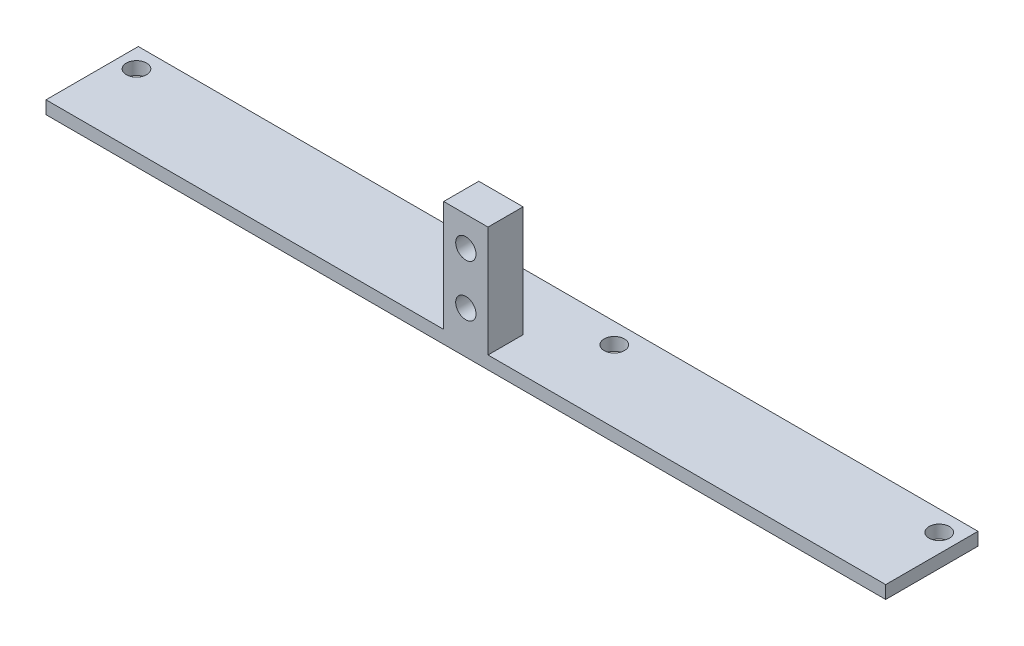
ISO-10303-21;
HEADER;
FILE_DESCRIPTION(('STEP AP214'),'2;1');
FILE_NAME('part.step','',(''),(''),'','','');
FILE_SCHEMA(('AUTOMOTIVE_DESIGN { 1 0 10303 214 1 1 1 1 }'));
ENDSEC;
DATA;
#1=APPLICATION_CONTEXT('core data for automotive mechanical design processes');
#2=APPLICATION_PROTOCOL_DEFINITION('international standard','automotive_design',2000,#1);
#3=PRODUCT_CONTEXT('',#1,'mechanical');
#4=PRODUCT('Part','Part','',(#3));
#5=PRODUCT_RELATED_PRODUCT_CATEGORY('part','',(#4));
#6=PRODUCT_DEFINITION_FORMATION('','',#4);
#7=PRODUCT_DEFINITION_CONTEXT('part definition',#1,'design');
#8=PRODUCT_DEFINITION('design','',#6,#7);
#9=PRODUCT_DEFINITION_SHAPE('','',#8);
#10=(LENGTH_UNIT() NAMED_UNIT(*) SI_UNIT(.MILLI.,.METRE.));
#11=(NAMED_UNIT(*) PLANE_ANGLE_UNIT() SI_UNIT($,.RADIAN.));
#12=(NAMED_UNIT(*) SI_UNIT($,.STERADIAN.) SOLID_ANGLE_UNIT());
#13=UNCERTAINTY_MEASURE_WITH_UNIT(LENGTH_MEASURE(1.E-05),#10,'distance_accuracy_value','');
#14=(GEOMETRIC_REPRESENTATION_CONTEXT(3) GLOBAL_UNCERTAINTY_ASSIGNED_CONTEXT((#13)) GLOBAL_UNIT_ASSIGNED_CONTEXT((#10,
#11,#12)) REPRESENTATION_CONTEXT('',''));
#15=CARTESIAN_POINT('',(0.,0.,0.));
#16=DIRECTION('',(0.,0.,1.));
#17=DIRECTION('',(1.,0.,0.));
#18=AXIS2_PLACEMENT_3D('',#15,#16,#17);
#19=CARTESIAN_POINT('',(0.,1.75,0.));
#20=DIRECTION('',(0.,0.,-1.));
#21=DIRECTION('',(-1.,0.,0.));
#22=AXIS2_PLACEMENT_3D('',#19,#20,#21);
#23=PLANE('',#22);
#24=CARTESIAN_POINT('',(57.35,5.75,0.));
#25=DIRECTION('',(0.,0.,-1.));
#26=DIRECTION('',(-1.,0.,0.));
#27=AXIS2_PLACEMENT_3D('',#24,#25,#26);
#28=CIRCLE('',#27,1.375);
#29=CARTESIAN_POINT('',(55.975,5.75,0.));
#30=VERTEX_POINT('',#29);
#31=EDGE_CURVE('E215',#30,#30,#28,.T.);
#32=ORIENTED_EDGE('',*,*,#31,.T.);
#33=EDGE_LOOP('',(#32));
#34=FACE_BOUND('',#33,.T.);
#35=CARTESIAN_POINT('',(57.35,12.75,0.));
#36=DIRECTION('',(0.,0.,-1.));
#37=DIRECTION('',(-1.,0.,0.));
#38=AXIS2_PLACEMENT_3D('',#35,#36,#37);
#39=CIRCLE('',#38,1.375);
#40=CARTESIAN_POINT('',(55.975,12.75,0.));
#41=VERTEX_POINT('',#40);
#42=EDGE_CURVE('E201',#41,#41,#39,.T.);
#43=ORIENTED_EDGE('',*,*,#42,.T.);
#44=EDGE_LOOP('',(#43));
#45=FACE_BOUND('',#44,.T.);
#46=DIRECTION('',(1.,0.,0.));
#47=VECTOR('',#46,1.);
#48=CARTESIAN_POINT('',(0.,0.,0.));
#49=LINE('',#48,#47);
#50=CARTESIAN_POINT('',(0.5,0.,0.));
#51=VERTEX_POINT('',#50);
#52=CARTESIAN_POINT('',(114.2,0.,0.));
#53=VERTEX_POINT('',#52);
#54=EDGE_CURVE('E128',#51,#53,#49,.T.);
#55=ORIENTED_EDGE('',*,*,#54,.T.);
#56=DIRECTION('',(0.,1.,0.));
#57=VECTOR('',#56,1.);
#58=CARTESIAN_POINT('',(114.2,0.,0.));
#59=LINE('',#58,#57);
#60=CARTESIAN_POINT('',(114.2,1.75,0.));
#61=VERTEX_POINT('',#60);
#62=EDGE_CURVE('E67',#53,#61,#59,.T.);
#63=ORIENTED_EDGE('',*,*,#62,.T.);
#64=DIRECTION('',(1.,0.,0.));
#65=VECTOR('',#64,1.);
#66=CARTESIAN_POINT('',(0.,1.75,0.));
#67=LINE('',#66,#65);
#68=CARTESIAN_POINT('',(60.35,1.75,0.));
#69=VERTEX_POINT('',#68);
#70=EDGE_CURVE('E127',#69,#61,#67,.T.);
#71=ORIENTED_EDGE('',*,*,#70,.F.);
#72=DIRECTION('',(0.,1.,0.));
#73=VECTOR('',#72,1.);
#74=CARTESIAN_POINT('',(60.35,0.,0.));
#75=LINE('',#74,#73);
#76=CARTESIAN_POINT('',(60.35,16.75,0.));
#77=VERTEX_POINT('',#76);
#78=EDGE_CURVE('E194',#69,#77,#75,.T.);
#79=ORIENTED_EDGE('',*,*,#78,.T.);
#80=DIRECTION('',(-1.,0.,0.));
#81=VECTOR('',#80,1.);
#82=CARTESIAN_POINT('',(54.35,16.75,0.));
#83=LINE('',#82,#81);
#84=CARTESIAN_POINT('',(54.35,16.75,0.));
#85=VERTEX_POINT('',#84);
#86=EDGE_CURVE('E189',#77,#85,#83,.T.);
#87=ORIENTED_EDGE('',*,*,#86,.T.);
#88=DIRECTION('',(0.,-1.,0.));
#89=VECTOR('',#88,1.);
#90=CARTESIAN_POINT('',(54.35,0.,0.));
#91=LINE('',#90,#89);
#92=CARTESIAN_POINT('',(54.35,1.75,0.));
#93=VERTEX_POINT('',#92);
#94=EDGE_CURVE('E197',#85,#93,#91,.T.);
#95=ORIENTED_EDGE('',*,*,#94,.T.);
#96=CARTESIAN_POINT('',(0.5,1.75,0.));
#97=VERTEX_POINT('',#96);
#98=EDGE_CURVE('E51',#97,#93,#67,.T.);
#99=ORIENTED_EDGE('',*,*,#98,.F.);
#100=DIRECTION('',(0.,1.,0.));
#101=VECTOR('',#100,1.);
#102=CARTESIAN_POINT('',(0.5,0.,0.));
#103=LINE('',#102,#101);
#104=EDGE_CURVE('E233',#51,#97,#103,.T.);
#105=ORIENTED_EDGE('',*,*,#104,.F.);
#106=EDGE_LOOP('',(#55,#63,#71,#79,#87,#95,#99,#105));
#107=FACE_BOUND('',#106,.T.);
#108=ADVANCED_FACE('F42',(#34,#45,#107),#23,.F.);
#109=CARTESIAN_POINT('',(0.,1.75,-12.5));
#110=DIRECTION('',(0.,0.,1.));
#111=DIRECTION('',(1.,0.,0.));
#112=AXIS2_PLACEMENT_3D('',#109,#110,#111);
#113=PLANE('',#112);
#114=DIRECTION('',(-1.,0.,0.));
#115=VECTOR('',#114,1.);
#116=CARTESIAN_POINT('',(0.,1.75,-12.5));
#117=LINE('',#116,#115);
#118=CARTESIAN_POINT('',(114.2,1.75,-12.5));
#119=VERTEX_POINT('',#118);
#120=CARTESIAN_POINT('',(0.5,1.75,-12.5));
#121=VERTEX_POINT('',#120);
#122=EDGE_CURVE('E11',#119,#121,#117,.T.);
#123=ORIENTED_EDGE('',*,*,#122,.F.);
#124=DIRECTION('',(0.,1.,0.));
#125=VECTOR('',#124,1.);
#126=CARTESIAN_POINT('',(114.2,0.,-12.5));
#127=LINE('',#126,#125);
#128=CARTESIAN_POINT('',(114.2,0.,-12.5));
#129=VERTEX_POINT('',#128);
#130=EDGE_CURVE('E109',#129,#119,#127,.T.);
#131=ORIENTED_EDGE('',*,*,#130,.F.);
#132=DIRECTION('',(-1.,0.,0.));
#133=VECTOR('',#132,1.);
#134=CARTESIAN_POINT('',(0.,0.,-12.5));
#135=LINE('',#134,#133);
#136=CARTESIAN_POINT('',(0.5,0.,-12.5));
#137=VERTEX_POINT('',#136);
#138=EDGE_CURVE('E45',#129,#137,#135,.T.);
#139=ORIENTED_EDGE('',*,*,#138,.T.);
#140=DIRECTION('',(0.,1.,0.));
#141=VECTOR('',#140,1.);
#142=CARTESIAN_POINT('',(0.5,0.,-12.5));
#143=LINE('',#142,#141);
#144=EDGE_CURVE('E59',#137,#121,#143,.T.);
#145=ORIENTED_EDGE('',*,*,#144,.T.);
#146=EDGE_LOOP('',(#123,#131,#139,#145));
#147=FACE_BOUND('',#146,.T.);
#148=ADVANCED_FACE('F120',(#147),#113,.F.);
#149=CARTESIAN_POINT('',(0.,1.75,0.));
#150=DIRECTION('',(0.,-1.,0.));
#151=DIRECTION('',(0.,0.,-1.));
#152=AXIS2_PLACEMENT_3D('',#149,#150,#151);
#153=PLANE('',#152);
#154=ORIENTED_EDGE('',*,*,#70,.T.);
#155=DIRECTION('',(0.,0.,-1.));
#156=VECTOR('',#155,1.);
#157=CARTESIAN_POINT('',(114.2,1.75,0.));
#158=LINE('',#157,#156);
#159=EDGE_CURVE('E223',#61,#119,#158,.T.);
#160=ORIENTED_EDGE('',*,*,#159,.T.);
#161=ORIENTED_EDGE('',*,*,#122,.T.);
#162=DIRECTION('',(0.,0.,1.));
#163=VECTOR('',#162,1.);
#164=CARTESIAN_POINT('',(0.5,1.75,0.));
#165=LINE('',#164,#163);
#166=EDGE_CURVE('E229',#121,#97,#165,.T.);
#167=ORIENTED_EDGE('',*,*,#166,.T.);
#168=ORIENTED_EDGE('',*,*,#98,.T.);
#169=DIRECTION('',(0.,0.,-1.));
#170=VECTOR('',#169,1.);
#171=CARTESIAN_POINT('',(54.35,1.75,0.));
#172=LINE('',#171,#170);
#173=CARTESIAN_POINT('',(54.35,1.75,-4.75));
#174=VERTEX_POINT('',#173);
#175=EDGE_CURVE('E149',#93,#174,#172,.T.);
#176=ORIENTED_EDGE('',*,*,#175,.T.);
#177=DIRECTION('',(1.,0.,0.));
#178=VECTOR('',#177,1.);
#179=CARTESIAN_POINT('',(0.,1.75,-4.75));
#180=LINE('',#179,#178);
#181=CARTESIAN_POINT('',(60.35,1.75,-4.75));
#182=VERTEX_POINT('',#181);
#183=EDGE_CURVE('E178',#174,#182,#180,.T.);
#184=ORIENTED_EDGE('',*,*,#183,.T.);
#185=DIRECTION('',(0.,0.,1.));
#186=VECTOR('',#185,1.);
#187=CARTESIAN_POINT('',(60.35,1.75,0.));
#188=LINE('',#187,#186);
#189=EDGE_CURVE('E174',#182,#69,#188,.T.);
#190=ORIENTED_EDGE('',*,*,#189,.T.);
#191=EDGE_LOOP('',(#154,#160,#161,#167,#168,#176,#184,#190));
#192=FACE_BOUND('',#191,.T.);
#193=CARTESIAN_POINT('',(3.,1.75,-9.75));
#194=DIRECTION('',(0.,1.,0.));
#195=DIRECTION('',(0.,0.,1.));
#196=AXIS2_PLACEMENT_3D('',#193,#194,#195);
#197=CIRCLE('',#196,1.375);
#198=CARTESIAN_POINT('',(3.,1.75,-8.375));
#199=VERTEX_POINT('',#198);
#200=EDGE_CURVE('E140',#199,#199,#197,.T.);
#201=ORIENTED_EDGE('',*,*,#200,.F.);
#202=EDGE_LOOP('',(#201));
#203=FACE_BOUND('',#202,.T.);
#204=CARTESIAN_POINT('',(47.,1.75,-9.75));
#205=DIRECTION('',(0.,1.,0.));
#206=DIRECTION('',(0.,0.,1.));
#207=AXIS2_PLACEMENT_3D('',#204,#205,#206);
#208=CIRCLE('',#207,1.375);
#209=CARTESIAN_POINT('',(47.,1.75,-8.37499999999999));
#210=VERTEX_POINT('',#209);
#211=EDGE_CURVE('E161',#210,#210,#208,.T.);
#212=ORIENTED_EDGE('',*,*,#211,.F.);
#213=EDGE_LOOP('',(#212));
#214=FACE_BOUND('',#213,.T.);
#215=CARTESIAN_POINT('',(67.7,1.75,-9.75));
#216=DIRECTION('',(0.,1.,0.));
#217=DIRECTION('',(0.,0.,-1.));
#218=AXIS2_PLACEMENT_3D('',#215,#216,#217);
#219=CIRCLE('',#218,1.375);
#220=CARTESIAN_POINT('',(67.7,1.75,-11.125));
#221=VERTEX_POINT('',#220);
#222=EDGE_CURVE('E153',#221,#221,#219,.T.);
#223=ORIENTED_EDGE('',*,*,#222,.F.);
#224=EDGE_LOOP('',(#223));
#225=FACE_BOUND('',#224,.T.);
#226=CARTESIAN_POINT('',(111.7,1.75,-9.75));
#227=DIRECTION('',(0.,1.,0.));
#228=DIRECTION('',(0.,0.,-1.));
#229=AXIS2_PLACEMENT_3D('',#226,#227,#228);
#230=CIRCLE('',#229,1.375);
#231=CARTESIAN_POINT('',(111.7,1.75,-11.125));
#232=VERTEX_POINT('',#231);
#233=EDGE_CURVE('E144',#232,#232,#230,.T.);
#234=ORIENTED_EDGE('',*,*,#233,.F.);
#235=EDGE_LOOP('',(#234));
#236=FACE_BOUND('',#235,.T.);
#237=ADVANCED_FACE('F243',(#192,#203,#214,#225,#236),#153,.F.);
#238=CARTESIAN_POINT('',(0.,0.,0.));
#239=DIRECTION('',(0.,-1.,0.));
#240=DIRECTION('',(0.,0.,-1.));
#241=AXIS2_PLACEMENT_3D('',#238,#239,#240);
#242=PLANE('',#241);
#243=DIRECTION('',(0.,0.,1.));
#244=VECTOR('',#243,1.);
#245=CARTESIAN_POINT('',(114.2,0.,-12.5));
#246=LINE('',#245,#244);
#247=EDGE_CURVE('E106',#129,#53,#246,.T.);
#248=ORIENTED_EDGE('',*,*,#247,.T.);
#249=ORIENTED_EDGE('',*,*,#54,.F.);
#250=DIRECTION('',(0.,0.,-1.));
#251=VECTOR('',#250,1.);
#252=CARTESIAN_POINT('',(0.5,0.,-12.5));
#253=LINE('',#252,#251);
#254=EDGE_CURVE('E125',#51,#137,#253,.T.);
#255=ORIENTED_EDGE('',*,*,#254,.T.);
#256=ORIENTED_EDGE('',*,*,#138,.F.);
#257=EDGE_LOOP('',(#248,#249,#255,#256));
#258=FACE_BOUND('',#257,.T.);
#259=CARTESIAN_POINT('',(3.,0.,-9.75));
#260=DIRECTION('',(0.,1.,0.));
#261=DIRECTION('',(0.,0.,1.));
#262=AXIS2_PLACEMENT_3D('',#259,#260,#261);
#263=CIRCLE('',#262,1.375);
#264=CARTESIAN_POINT('',(3.,0.,-8.375));
#265=VERTEX_POINT('',#264);
#266=EDGE_CURVE('E134',#265,#265,#263,.T.);
#267=ORIENTED_EDGE('',*,*,#266,.T.);
#268=EDGE_LOOP('',(#267));
#269=FACE_BOUND('',#268,.T.);
#270=CARTESIAN_POINT('',(47.,0.,-9.75));
#271=DIRECTION('',(0.,1.,0.));
#272=DIRECTION('',(0.,0.,1.));
#273=AXIS2_PLACEMENT_3D('',#270,#271,#272);
#274=CIRCLE('',#273,1.375);
#275=CARTESIAN_POINT('',(47.,0.,-8.37499999999999));
#276=VERTEX_POINT('',#275);
#277=EDGE_CURVE('E165',#276,#276,#274,.T.);
#278=ORIENTED_EDGE('',*,*,#277,.T.);
#279=EDGE_LOOP('',(#278));
#280=FACE_BOUND('',#279,.T.);
#281=CARTESIAN_POINT('',(67.7,0.,-9.75));
#282=DIRECTION('',(0.,1.,0.));
#283=DIRECTION('',(0.,0.,-1.));
#284=AXIS2_PLACEMENT_3D('',#281,#282,#283);
#285=CIRCLE('',#284,1.375);
#286=CARTESIAN_POINT('',(67.7,0.,-11.125));
#287=VERTEX_POINT('',#286);
#288=EDGE_CURVE('E157',#287,#287,#285,.T.);
#289=ORIENTED_EDGE('',*,*,#288,.T.);
#290=EDGE_LOOP('',(#289));
#291=FACE_BOUND('',#290,.T.);
#292=CARTESIAN_POINT('',(111.7,0.,-9.75));
#293=DIRECTION('',(0.,1.,0.));
#294=DIRECTION('',(0.,0.,-1.));
#295=AXIS2_PLACEMENT_3D('',#292,#293,#294);
#296=CIRCLE('',#295,1.375);
#297=CARTESIAN_POINT('',(111.7,0.,-11.125));
#298=VERTEX_POINT('',#297);
#299=EDGE_CURVE('E148',#298,#298,#296,.T.);
#300=ORIENTED_EDGE('',*,*,#299,.T.);
#301=EDGE_LOOP('',(#300));
#302=FACE_BOUND('',#301,.T.);
#303=ADVANCED_FACE('F123',(#258,#269,#280,#291,#302),#242,.T.);
#304=CARTESIAN_POINT('',(111.7,0.,-9.75));
#305=DIRECTION('',(0.,1.,0.));
#306=DIRECTION('',(0.,0.,1.));
#307=AXIS2_PLACEMENT_3D('',#304,#305,#306);
#308=CYLINDRICAL_SURFACE('',#307,1.375);
#309=ORIENTED_EDGE('',*,*,#299,.F.);
#310=EDGE_LOOP('',(#309));
#311=FACE_BOUND('',#310,.T.);
#312=ORIENTED_EDGE('',*,*,#233,.T.);
#313=EDGE_LOOP('',(#312));
#314=FACE_BOUND('',#313,.T.);
#315=ADVANCED_FACE('F369',(#311,#314),#308,.F.);
#316=CARTESIAN_POINT('',(67.7,0.,-9.75));
#317=DIRECTION('',(0.,1.,0.));
#318=DIRECTION('',(0.,0.,1.));
#319=AXIS2_PLACEMENT_3D('',#316,#317,#318);
#320=CYLINDRICAL_SURFACE('',#319,1.375);
#321=ORIENTED_EDGE('',*,*,#288,.F.);
#322=EDGE_LOOP('',(#321));
#323=FACE_BOUND('',#322,.T.);
#324=ORIENTED_EDGE('',*,*,#222,.T.);
#325=EDGE_LOOP('',(#324));
#326=FACE_BOUND('',#325,.T.);
#327=ADVANCED_FACE('F359',(#323,#326),#320,.F.);
#328=CARTESIAN_POINT('',(47.,0.,-9.75));
#329=DIRECTION('',(0.,1.,0.));
#330=DIRECTION('',(0.,0.,1.));
#331=AXIS2_PLACEMENT_3D('',#328,#329,#330);
#332=CYLINDRICAL_SURFACE('',#331,1.375);
#333=ORIENTED_EDGE('',*,*,#277,.F.);
#334=EDGE_LOOP('',(#333));
#335=FACE_BOUND('',#334,.T.);
#336=ORIENTED_EDGE('',*,*,#211,.T.);
#337=EDGE_LOOP('',(#336));
#338=FACE_BOUND('',#337,.T.);
#339=ADVANCED_FACE('F349',(#335,#338),#332,.F.);
#340=CARTESIAN_POINT('',(3.,0.,-9.75));
#341=DIRECTION('',(0.,1.,0.));
#342=DIRECTION('',(0.,0.,1.));
#343=AXIS2_PLACEMENT_3D('',#340,#341,#342);
#344=CYLINDRICAL_SURFACE('',#343,1.375);
#345=ORIENTED_EDGE('',*,*,#266,.F.);
#346=EDGE_LOOP('',(#345));
#347=FACE_BOUND('',#346,.T.);
#348=ORIENTED_EDGE('',*,*,#200,.T.);
#349=EDGE_LOOP('',(#348));
#350=FACE_BOUND('',#349,.T.);
#351=ADVANCED_FACE('F340',(#347,#350),#344,.F.);
#352=CARTESIAN_POINT('',(54.35,0.,-4.75));
#353=DIRECTION('',(-1.,0.,0.));
#354=DIRECTION('',(0.,0.,1.));
#355=AXIS2_PLACEMENT_3D('',#352,#353,#354);
#356=PLANE('',#355);
#357=ORIENTED_EDGE('',*,*,#175,.F.);
#358=ORIENTED_EDGE('',*,*,#94,.F.);
#359=DIRECTION('',(0.,0.,1.));
#360=VECTOR('',#359,1.);
#361=CARTESIAN_POINT('',(54.35,16.75,-4.75));
#362=LINE('',#361,#360);
#363=CARTESIAN_POINT('',(54.35,16.75,-4.75));
#364=VERTEX_POINT('',#363);
#365=EDGE_CURVE('E181',#364,#85,#362,.T.);
#366=ORIENTED_EDGE('',*,*,#365,.F.);
#367=DIRECTION('',(0.,-1.,0.));
#368=VECTOR('',#367,1.);
#369=CARTESIAN_POINT('',(54.35,0.,-4.75));
#370=LINE('',#369,#368);
#371=EDGE_CURVE('E193',#364,#174,#370,.T.);
#372=ORIENTED_EDGE('',*,*,#371,.T.);
#373=EDGE_LOOP('',(#357,#358,#366,#372));
#374=FACE_BOUND('',#373,.T.);
#375=ADVANCED_FACE('F261',(#374),#356,.T.);
#376=CARTESIAN_POINT('',(60.35,0.,-4.75));
#377=DIRECTION('',(1.,0.,0.));
#378=DIRECTION('',(0.,1.,0.));
#379=AXIS2_PLACEMENT_3D('',#376,#377,#378);
#380=PLANE('',#379);
#381=ORIENTED_EDGE('',*,*,#189,.F.);
#382=DIRECTION('',(0.,1.,0.));
#383=VECTOR('',#382,1.);
#384=CARTESIAN_POINT('',(60.35,0.,-4.75));
#385=LINE('',#384,#383);
#386=CARTESIAN_POINT('',(60.35,16.75,-4.75));
#387=VERTEX_POINT('',#386);
#388=EDGE_CURVE('E205',#182,#387,#385,.T.);
#389=ORIENTED_EDGE('',*,*,#388,.T.);
#390=DIRECTION('',(0.,0.,1.));
#391=VECTOR('',#390,1.);
#392=CARTESIAN_POINT('',(60.35,16.75,-4.75));
#393=LINE('',#392,#391);
#394=EDGE_CURVE('E182',#387,#77,#393,.T.);
#395=ORIENTED_EDGE('',*,*,#394,.T.);
#396=ORIENTED_EDGE('',*,*,#78,.F.);
#397=EDGE_LOOP('',(#381,#389,#395,#396));
#398=FACE_BOUND('',#397,.T.);
#399=ADVANCED_FACE('F250',(#398),#380,.T.);
#400=CARTESIAN_POINT('',(0.,0.,-4.75));
#401=DIRECTION('',(0.,0.,-1.));
#402=DIRECTION('',(-1.,0.,0.));
#403=AXIS2_PLACEMENT_3D('',#400,#401,#402);
#404=PLANE('',#403);
#405=CARTESIAN_POINT('',(57.35,5.75,-4.75));
#406=DIRECTION('',(0.,0.,-1.));
#407=DIRECTION('',(-1.,0.,0.));
#408=AXIS2_PLACEMENT_3D('',#405,#406,#407);
#409=CIRCLE('',#408,1.375);
#410=CARTESIAN_POINT('',(55.975,5.75,-4.75));
#411=VERTEX_POINT('',#410);
#412=EDGE_CURVE('E219',#411,#411,#409,.T.);
#413=ORIENTED_EDGE('',*,*,#412,.F.);
#414=EDGE_LOOP('',(#413));
#415=FACE_BOUND('',#414,.T.);
#416=CARTESIAN_POINT('',(57.35,12.75,-4.75));
#417=DIRECTION('',(0.,0.,-1.));
#418=DIRECTION('',(-1.,0.,0.));
#419=AXIS2_PLACEMENT_3D('',#416,#417,#418);
#420=CIRCLE('',#419,1.375);
#421=CARTESIAN_POINT('',(55.975,12.75,-4.75));
#422=VERTEX_POINT('',#421);
#423=EDGE_CURVE('E211',#422,#422,#420,.T.);
#424=ORIENTED_EDGE('',*,*,#423,.F.);
#425=EDGE_LOOP('',(#424));
#426=FACE_BOUND('',#425,.T.);
#427=ORIENTED_EDGE('',*,*,#183,.F.);
#428=ORIENTED_EDGE('',*,*,#371,.F.);
#429=DIRECTION('',(-1.,0.,0.));
#430=VECTOR('',#429,1.);
#431=CARTESIAN_POINT('',(54.35,16.75,-4.75));
#432=LINE('',#431,#430);
#433=EDGE_CURVE('E186',#387,#364,#432,.T.);
#434=ORIENTED_EDGE('',*,*,#433,.F.);
#435=ORIENTED_EDGE('',*,*,#388,.F.);
#436=EDGE_LOOP('',(#427,#428,#434,#435));
#437=FACE_BOUND('',#436,.T.);
#438=ADVANCED_FACE('F263',(#415,#426,#437),#404,.T.);
#439=CARTESIAN_POINT('',(54.35,16.75,-4.75));
#440=DIRECTION('',(0.,1.,0.));
#441=DIRECTION('',(0.,0.,1.));
#442=AXIS2_PLACEMENT_3D('',#439,#440,#441);
#443=PLANE('',#442);
#444=ORIENTED_EDGE('',*,*,#86,.F.);
#445=ORIENTED_EDGE('',*,*,#394,.F.);
#446=ORIENTED_EDGE('',*,*,#433,.T.);
#447=ORIENTED_EDGE('',*,*,#365,.T.);
#448=EDGE_LOOP('',(#444,#445,#446,#447));
#449=FACE_BOUND('',#448,.T.);
#450=ADVANCED_FACE('F256',(#449),#443,.T.);
#451=CARTESIAN_POINT('',(57.35,12.75,0.));
#452=DIRECTION('',(0.,0.,-1.));
#453=DIRECTION('',(-1.,0.,0.));
#454=AXIS2_PLACEMENT_3D('',#451,#452,#453);
#455=CYLINDRICAL_SURFACE('',#454,1.375);
#456=ORIENTED_EDGE('',*,*,#42,.F.);
#457=EDGE_LOOP('',(#456));
#458=FACE_BOUND('',#457,.T.);
#459=ORIENTED_EDGE('',*,*,#423,.T.);
#460=EDGE_LOOP('',(#459));
#461=FACE_BOUND('',#460,.T.);
#462=ADVANCED_FACE('F271',(#458,#461),#455,.F.);
#463=CARTESIAN_POINT('',(57.35,5.75,0.));
#464=DIRECTION('',(0.,0.,-1.));
#465=DIRECTION('',(-1.,0.,0.));
#466=AXIS2_PLACEMENT_3D('',#463,#464,#465);
#467=CYLINDRICAL_SURFACE('',#466,1.375);
#468=ORIENTED_EDGE('',*,*,#31,.F.);
#469=EDGE_LOOP('',(#468));
#470=FACE_BOUND('',#469,.T.);
#471=ORIENTED_EDGE('',*,*,#412,.T.);
#472=EDGE_LOOP('',(#471));
#473=FACE_BOUND('',#472,.T.);
#474=ADVANCED_FACE('F288',(#470,#473),#467,.F.);
#475=CARTESIAN_POINT('',(0.5,0.,-12.5));
#476=DIRECTION('',(1.,0.,0.));
#477=DIRECTION('',(0.,0.,-1.));
#478=AXIS2_PLACEMENT_3D('',#475,#476,#477);
#479=PLANE('',#478);
#480=ORIENTED_EDGE('',*,*,#144,.F.);
#481=ORIENTED_EDGE('',*,*,#254,.F.);
#482=ORIENTED_EDGE('',*,*,#104,.T.);
#483=ORIENTED_EDGE('',*,*,#166,.F.);
#484=EDGE_LOOP('',(#480,#481,#482,#483));
#485=FACE_BOUND('',#484,.T.);
#486=ADVANCED_FACE('F293',(#485),#479,.F.);
#487=CARTESIAN_POINT('',(114.2,0.,-12.5));
#488=DIRECTION('',(-1.,0.,0.));
#489=DIRECTION('',(0.,0.,1.));
#490=AXIS2_PLACEMENT_3D('',#487,#488,#489);
#491=PLANE('',#490);
#492=ORIENTED_EDGE('',*,*,#62,.F.);
#493=ORIENTED_EDGE('',*,*,#247,.F.);
#494=ORIENTED_EDGE('',*,*,#130,.T.);
#495=ORIENTED_EDGE('',*,*,#159,.F.);
#496=EDGE_LOOP('',(#492,#493,#494,#495));
#497=FACE_BOUND('',#496,.T.);
#498=ADVANCED_FACE('F108',(#497),#491,.F.);
#499=CLOSED_SHELL('',(#108,#148,#237,#303,#315,#327,#339,#351,#375,#399,#438,#450,#462,#474,
#486,#498));
#500=MANIFOLD_SOLID_BREP('B2',#499);
#501=ADVANCED_BREP_SHAPE_REPRESENTATION('',(#18,#500),#14);
#502=SHAPE_DEFINITION_REPRESENTATION(#9,#501);
ENDSEC;
END-ISO-10303-21;
